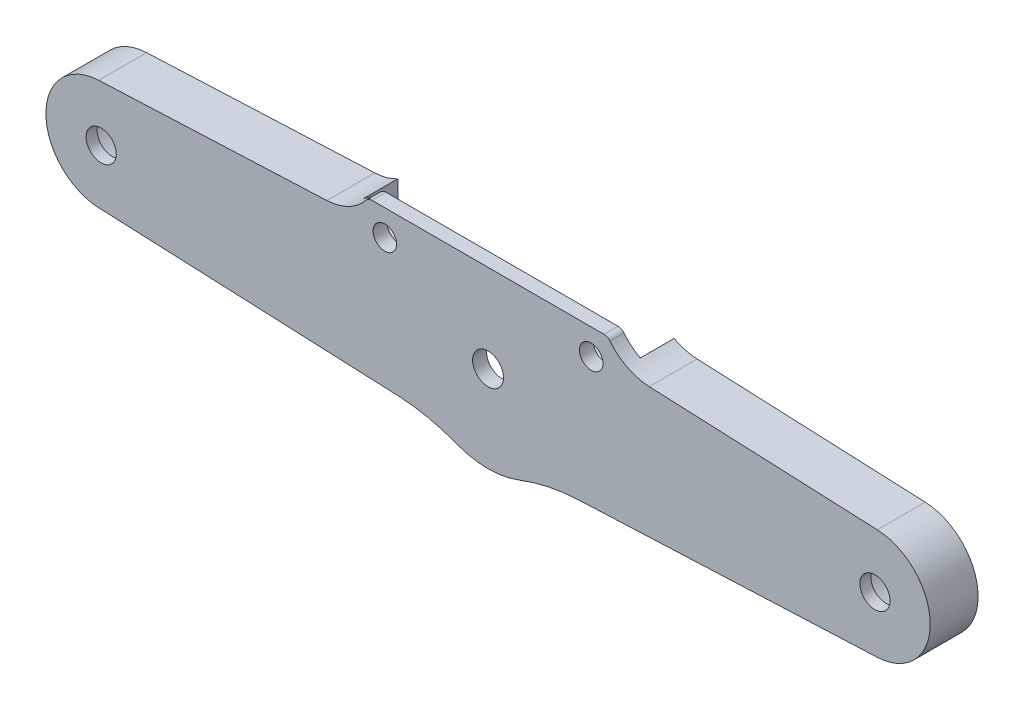
ISO-10303-21;
HEADER;
FILE_DESCRIPTION(('STEP AP214'),'2;1');
FILE_NAME('part.step','',(''),(''),'','','');
FILE_SCHEMA(('AUTOMOTIVE_DESIGN { 1 0 10303 214 1 1 1 1 }'));
ENDSEC;
DATA;
#1=APPLICATION_CONTEXT('core data for automotive mechanical design processes');
#2=APPLICATION_PROTOCOL_DEFINITION('international standard','automotive_design',2000,#1);
#3=PRODUCT_CONTEXT('',#1,'mechanical');
#4=PRODUCT('Part','Part','',(#3));
#5=PRODUCT_RELATED_PRODUCT_CATEGORY('part','',(#4));
#6=PRODUCT_DEFINITION_FORMATION('','',#4);
#7=PRODUCT_DEFINITION_CONTEXT('part definition',#1,'design');
#8=PRODUCT_DEFINITION('design','',#6,#7);
#9=PRODUCT_DEFINITION_SHAPE('','',#8);
#10=(LENGTH_UNIT() NAMED_UNIT(*) SI_UNIT(.MILLI.,.METRE.));
#11=(NAMED_UNIT(*) PLANE_ANGLE_UNIT() SI_UNIT($,.RADIAN.));
#12=(NAMED_UNIT(*) SI_UNIT($,.STERADIAN.) SOLID_ANGLE_UNIT());
#13=UNCERTAINTY_MEASURE_WITH_UNIT(LENGTH_MEASURE(1.E-05),#10,'distance_accuracy_value','');
#14=(GEOMETRIC_REPRESENTATION_CONTEXT(3) GLOBAL_UNCERTAINTY_ASSIGNED_CONTEXT((#13)) GLOBAL_UNIT_ASSIGNED_CONTEXT((#10,
#11,#12)) REPRESENTATION_CONTEXT('',''));
#15=CARTESIAN_POINT('',(0.,0.,0.));
#16=DIRECTION('',(0.,0.,1.));
#17=DIRECTION('',(1.,0.,0.));
#18=AXIS2_PLACEMENT_3D('',#15,#16,#17);
#19=CARTESIAN_POINT('',(-33.5,203.35,52.5));
#20=DIRECTION('',(0.,0.,1.));
#21=DIRECTION('',(1.,0.,0.));
#22=AXIS2_PLACEMENT_3D('',#19,#20,#21);
#23=CYLINDRICAL_SURFACE('',#22,4.);
#24=DIRECTION('',(0.,0.,-1.));
#25=VECTOR('',#24,1.);
#26=CARTESIAN_POINT('',(-33.5,199.35,52.5));
#27=LINE('',#26,#25);
#28=CARTESIAN_POINT('',(-33.5,199.35,61.7));
#29=VERTEX_POINT('',#28);
#30=CARTESIAN_POINT('',(-33.5,199.35,52.5));
#31=VERTEX_POINT('',#30);
#32=EDGE_CURVE('E214',#29,#31,#27,.T.);
#33=ORIENTED_EDGE('',*,*,#32,.T.);
#34=CARTESIAN_POINT('',(-33.5,203.35,52.5));
#35=DIRECTION('',(0.,0.,1.));
#36=DIRECTION('',(1.,0.,0.));
#37=AXIS2_PLACEMENT_3D('',#34,#35,#36);
#38=CIRCLE('',#37,4.);
#39=CARTESIAN_POINT('',(-37.5,203.35,52.5));
#40=VERTEX_POINT('',#39);
#41=EDGE_CURVE('E332',#31,#40,#38,.F.);
#42=ORIENTED_EDGE('',*,*,#41,.T.);
#43=DIRECTION('',(0.,0.,1.));
#44=VECTOR('',#43,1.);
#45=CARTESIAN_POINT('',(-37.5,203.35,52.5));
#46=LINE('',#45,#44);
#47=CARTESIAN_POINT('',(-37.5,203.35,61.7));
#48=VERTEX_POINT('',#47);
#49=EDGE_CURVE('E173',#40,#48,#46,.T.);
#50=ORIENTED_EDGE('',*,*,#49,.T.);
#51=CARTESIAN_POINT('',(-33.5,203.35,61.7));
#52=DIRECTION('',(0.,0.,1.));
#53=DIRECTION('',(1.,0.,0.));
#54=AXIS2_PLACEMENT_3D('',#51,#52,#53);
#55=CIRCLE('',#54,4.);
#56=EDGE_CURVE('E181',#29,#48,#55,.F.);
#57=ORIENTED_EDGE('',*,*,#56,.F.);
#58=EDGE_LOOP('',(#33,#42,#50,#57));
#59=FACE_BOUND('',#58,.T.);
#60=ADVANCED_FACE('F16',(#59),#23,.F.);
#61=CARTESIAN_POINT('',(33.5,203.35,52.5));
#62=DIRECTION('',(0.,0.,1.));
#63=DIRECTION('',(1.,0.,0.));
#64=AXIS2_PLACEMENT_3D('',#61,#62,#63);
#65=CYLINDRICAL_SURFACE('',#64,4.);
#66=DIRECTION('',(0.,0.,1.));
#67=VECTOR('',#66,1.);
#68=CARTESIAN_POINT('',(37.5,203.35,52.5));
#69=LINE('',#68,#67);
#70=CARTESIAN_POINT('',(37.5,203.35,61.7));
#71=VERTEX_POINT('',#70);
#72=CARTESIAN_POINT('',(37.5,203.35,52.5));
#73=VERTEX_POINT('',#72);
#74=EDGE_CURVE('E175',#71,#73,#69,.F.);
#75=ORIENTED_EDGE('',*,*,#74,.T.);
#76=CARTESIAN_POINT('',(33.5,203.35,52.5));
#77=DIRECTION('',(0.,0.,1.));
#78=DIRECTION('',(1.,0.,0.));
#79=AXIS2_PLACEMENT_3D('',#76,#77,#78);
#80=CIRCLE('',#79,4.);
#81=CARTESIAN_POINT('',(33.5,199.35,52.5));
#82=VERTEX_POINT('',#81);
#83=EDGE_CURVE('E19',#73,#82,#80,.F.);
#84=ORIENTED_EDGE('',*,*,#83,.T.);
#85=DIRECTION('',(0.,0.,1.));
#86=VECTOR('',#85,1.);
#87=CARTESIAN_POINT('',(33.5,199.35,52.5));
#88=LINE('',#87,#86);
#89=CARTESIAN_POINT('',(33.5,199.35,61.7));
#90=VERTEX_POINT('',#89);
#91=EDGE_CURVE('E218',#82,#90,#88,.T.);
#92=ORIENTED_EDGE('',*,*,#91,.T.);
#93=CARTESIAN_POINT('',(33.5,203.35,61.7));
#94=DIRECTION('',(0.,0.,1.));
#95=DIRECTION('',(1.,0.,0.));
#96=AXIS2_PLACEMENT_3D('',#93,#94,#95);
#97=CIRCLE('',#96,4.);
#98=EDGE_CURVE('E178',#71,#90,#97,.F.);
#99=ORIENTED_EDGE('',*,*,#98,.F.);
#100=EDGE_LOOP('',(#75,#84,#92,#99));
#101=FACE_BOUND('',#100,.T.);
#102=ADVANCED_FACE('F176',(#101),#65,.F.);
#103=CARTESIAN_POINT('',(17.113664131331,199.35,52.5));
#104=DIRECTION('',(0.,-1.,0.));
#105=DIRECTION('',(1.,0.,0.));
#106=AXIS2_PLACEMENT_3D('',#103,#104,#105);
#107=PLANE('',#106);
#108=DIRECTION('',(1.,0.,0.));
#109=VECTOR('',#108,1.);
#110=CARTESIAN_POINT('',(0.,199.35,52.5));
#111=LINE('',#110,#109);
#112=CARTESIAN_POINT('',(17.1136641313309,199.35,52.5));
#113=VERTEX_POINT('',#112);
#114=EDGE_CURVE('E170',#82,#113,#111,.F.);
#115=ORIENTED_EDGE('',*,*,#114,.T.);
#116=DIRECTION('',(0.,0.,1.));
#117=VECTOR('',#116,1.);
#118=CARTESIAN_POINT('',(17.1136641313309,199.35,52.5));
#119=LINE('',#118,#117);
#120=CARTESIAN_POINT('',(17.1136641313309,199.35,61.7));
#121=VERTEX_POINT('',#120);
#122=EDGE_CURVE('E215',#113,#121,#119,.T.);
#123=ORIENTED_EDGE('',*,*,#122,.T.);
#124=DIRECTION('',(-1.,0.,0.));
#125=VECTOR('',#124,1.);
#126=CARTESIAN_POINT('',(0.,199.35,61.7));
#127=LINE('',#126,#125);
#128=EDGE_CURVE('E323',#90,#121,#127,.T.);
#129=ORIENTED_EDGE('',*,*,#128,.F.);
#130=ORIENTED_EDGE('',*,*,#91,.F.);
#131=EDGE_LOOP('',(#115,#123,#129,#130));
#132=FACE_BOUND('',#131,.T.);
#133=ADVANCED_FACE('F340',(#132),#107,.F.);
#134=CARTESIAN_POINT('',(0.,189.,52.5));
#135=DIRECTION('',(0.,0.,1.));
#136=DIRECTION('',(1.,0.,0.));
#137=AXIS2_PLACEMENT_3D('',#134,#135,#136);
#138=CYLINDRICAL_SURFACE('',#137,20.);
#139=DIRECTION('',(0.,0.,-1.));
#140=VECTOR('',#139,1.);
#141=CARTESIAN_POINT('',(-17.113664131331,199.35,52.5));
#142=LINE('',#141,#140);
#143=CARTESIAN_POINT('',(-17.1136641313309,199.35,52.5));
#144=VERTEX_POINT('',#143);
#145=CARTESIAN_POINT('',(-17.1136641313309,199.35,61.7));
#146=VERTEX_POINT('',#145);
#147=EDGE_CURVE('E212',#144,#146,#142,.F.);
#148=ORIENTED_EDGE('',*,*,#147,.T.);
#149=CARTESIAN_POINT('',(0.,189.,61.7));
#150=DIRECTION('',(0.,0.,1.));
#151=DIRECTION('',(1.,0.,0.));
#152=AXIS2_PLACEMENT_3D('',#149,#150,#151);
#153=CIRCLE('',#152,20.);
#154=EDGE_CURVE('E320',#121,#146,#153,.F.);
#155=ORIENTED_EDGE('',*,*,#154,.F.);
#156=ORIENTED_EDGE('',*,*,#122,.F.);
#157=CARTESIAN_POINT('',(0.,189.,52.5));
#158=DIRECTION('',(0.,0.,1.));
#159=DIRECTION('',(1.,0.,0.));
#160=AXIS2_PLACEMENT_3D('',#157,#158,#159);
#161=CIRCLE('',#160,20.);
#162=EDGE_CURVE('E334',#113,#144,#161,.F.);
#163=ORIENTED_EDGE('',*,*,#162,.T.);
#164=EDGE_LOOP('',(#148,#155,#156,#163));
#165=FACE_BOUND('',#164,.T.);
#166=ADVANCED_FACE('F343',(#165),#138,.F.);
#167=CARTESIAN_POINT('',(-37.5,199.35,52.5));
#168=DIRECTION('',(0.,-1.,0.));
#169=DIRECTION('',(0.,0.,-1.));
#170=AXIS2_PLACEMENT_3D('',#167,#168,#169);
#171=PLANE('',#170);
#172=DIRECTION('',(-1.,0.,0.));
#173=VECTOR('',#172,1.);
#174=CARTESIAN_POINT('',(0.,199.35,61.7));
#175=LINE('',#174,#173);
#176=EDGE_CURVE('E319',#146,#29,#175,.T.);
#177=ORIENTED_EDGE('',*,*,#176,.F.);
#178=ORIENTED_EDGE('',*,*,#147,.F.);
#179=DIRECTION('',(1.,0.,0.));
#180=VECTOR('',#179,1.);
#181=CARTESIAN_POINT('',(0.,199.35,52.5));
#182=LINE('',#181,#180);
#183=EDGE_CURVE('E333',#144,#31,#182,.F.);
#184=ORIENTED_EDGE('',*,*,#183,.T.);
#185=ORIENTED_EDGE('',*,*,#32,.F.);
#186=EDGE_LOOP('',(#177,#178,#184,#185));
#187=FACE_BOUND('',#186,.T.);
#188=ADVANCED_FACE('F350',(#187),#171,.F.);
#189=CARTESIAN_POINT('',(105.,189.,52.5));
#190=DIRECTION('',(0.,0.,1.));
#191=DIRECTION('',(1.,0.,0.));
#192=AXIS2_PLACEMENT_3D('',#189,#190,#191);
#193=CYLINDRICAL_SURFACE('',#192,12.);
#194=CARTESIAN_POINT('',(105.,189.,62.5));
#195=DIRECTION('',(0.,0.,1.));
#196=DIRECTION('',(1.,0.,0.));
#197=AXIS2_PLACEMENT_3D('',#194,#195,#196);
#198=CIRCLE('',#197,12.);
#199=CARTESIAN_POINT('',(117.,189.,62.5));
#200=VERTEX_POINT('',#199);
#201=EDGE_CURVE('E316',#200,#200,#198,.F.);
#202=ORIENTED_EDGE('',*,*,#201,.F.);
#203=EDGE_LOOP('',(#202));
#204=FACE_BOUND('',#203,.T.);
#205=CARTESIAN_POINT('',(105.,189.,52.5));
#206=DIRECTION('',(0.,0.,1.));
#207=DIRECTION('',(1.,0.,0.));
#208=AXIS2_PLACEMENT_3D('',#205,#206,#207);
#209=CIRCLE('',#208,12.);
#210=CARTESIAN_POINT('',(117.,189.,52.5));
#211=VERTEX_POINT('',#210);
#212=EDGE_CURVE('E190',#211,#211,#209,.F.);
#213=ORIENTED_EDGE('',*,*,#212,.T.);
#214=EDGE_LOOP('',(#213));
#215=FACE_BOUND('',#214,.T.);
#216=ADVANCED_FACE('F680',(#204,#215),#193,.F.);
#217=CARTESIAN_POINT('',(-105.,189.,52.5));
#218=DIRECTION('',(0.,0.,1.));
#219=DIRECTION('',(1.,0.,0.));
#220=AXIS2_PLACEMENT_3D('',#217,#218,#219);
#221=CYLINDRICAL_SURFACE('',#220,12.);
#222=CARTESIAN_POINT('',(-105.,189.,62.5));
#223=DIRECTION('',(0.,0.,1.));
#224=DIRECTION('',(1.,0.,0.));
#225=AXIS2_PLACEMENT_3D('',#222,#223,#224);
#226=CIRCLE('',#225,12.);
#227=CARTESIAN_POINT('',(-93.,189.,62.5));
#228=VERTEX_POINT('',#227);
#229=EDGE_CURVE('E313',#228,#228,#226,.F.);
#230=ORIENTED_EDGE('',*,*,#229,.F.);
#231=EDGE_LOOP('',(#230));
#232=FACE_BOUND('',#231,.T.);
#233=CARTESIAN_POINT('',(-105.,189.,52.5));
#234=DIRECTION('',(0.,0.,1.));
#235=DIRECTION('',(1.,0.,0.));
#236=AXIS2_PLACEMENT_3D('',#233,#234,#235);
#237=CIRCLE('',#236,12.);
#238=CARTESIAN_POINT('',(-93.,189.,52.5));
#239=VERTEX_POINT('',#238);
#240=EDGE_CURVE('E187',#239,#239,#237,.F.);
#241=ORIENTED_EDGE('',*,*,#240,.T.);
#242=EDGE_LOOP('',(#241));
#243=FACE_BOUND('',#242,.T.);
#244=ADVANCED_FACE('F672',(#232,#243),#221,.F.);
#245=CARTESIAN_POINT('',(-37.5,208.40608142153,52.5));
#246=DIRECTION('',(-1.,0.,0.));
#247=DIRECTION('',(0.,0.,1.));
#248=AXIS2_PLACEMENT_3D('',#245,#246,#247);
#249=PLANE('',#248);
#250=DIRECTION('',(0.,1.,0.));
#251=VECTOR('',#250,1.);
#252=CARTESIAN_POINT('',(-37.5,189.175,52.5));
#253=LINE('',#252,#251);
#254=CARTESIAN_POINT('',(-37.5000000000001,208.40608142153,52.5));
#255=VERTEX_POINT('',#254);
#256=EDGE_CURVE('E331',#40,#255,#253,.T.);
#257=ORIENTED_EDGE('',*,*,#256,.T.);
#258=DIRECTION('',(0.,0.,1.));
#259=VECTOR('',#258,1.);
#260=CARTESIAN_POINT('',(-37.5000000000001,208.40608142153,52.5));
#261=LINE('',#260,#259);
#262=CARTESIAN_POINT('',(-37.5000000000001,208.40608142153,61.7));
#263=VERTEX_POINT('',#262);
#264=EDGE_CURVE('E208',#255,#263,#261,.T.);
#265=ORIENTED_EDGE('',*,*,#264,.T.);
#266=DIRECTION('',(0.,1.,0.));
#267=VECTOR('',#266,1.);
#268=CARTESIAN_POINT('',(-37.5,190.925,61.7));
#269=LINE('',#268,#267);
#270=EDGE_CURVE('E327',#48,#263,#269,.T.);
#271=ORIENTED_EDGE('',*,*,#270,.F.);
#272=ORIENTED_EDGE('',*,*,#49,.F.);
#273=EDGE_LOOP('',(#257,#265,#271,#272));
#274=FACE_BOUND('',#273,.T.);
#275=ADVANCED_FACE('F370',(#274),#249,.F.);
#276=CARTESIAN_POINT('',(0.,189.175,52.5));
#277=DIRECTION('',(0.,0.,1.));
#278=DIRECTION('',(1.,0.,0.));
#279=AXIS2_PLACEMENT_3D('',#276,#277,#278);
#280=PLANE('',#279);
#281=ORIENTED_EDGE('',*,*,#240,.F.);
#282=EDGE_LOOP('',(#281));
#283=FACE_BOUND('',#282,.T.);
#284=ORIENTED_EDGE('',*,*,#212,.F.);
#285=EDGE_LOOP('',(#284));
#286=FACE_BOUND('',#285,.T.);
#287=ORIENTED_EDGE('',*,*,#41,.F.);
#288=ORIENTED_EDGE('',*,*,#183,.F.);
#289=ORIENTED_EDGE('',*,*,#162,.F.);
#290=ORIENTED_EDGE('',*,*,#114,.F.);
#291=ORIENTED_EDGE('',*,*,#83,.F.);
#292=DIRECTION('',(0.,1.,0.));
#293=VECTOR('',#292,1.);
#294=CARTESIAN_POINT('',(37.5,199.35,52.5));
#295=LINE('',#294,#293);
#296=CARTESIAN_POINT('',(37.5,208.40608142153,52.5));
#297=VERTEX_POINT('',#296);
#298=EDGE_CURVE('E167',#73,#297,#295,.T.);
#299=ORIENTED_EDGE('',*,*,#298,.T.);
#300=CARTESIAN_POINT('',(44.370078815034,221.175263739722,52.5));
#301=DIRECTION('',(0.,0.,1.));
#302=DIRECTION('',(1.,0.,0.));
#303=AXIS2_PLACEMENT_3D('',#300,#301,#302);
#304=CIRCLE('',#303,14.5);
#305=CARTESIAN_POINT('',(43.7375976982367,206.689064526785,52.5));
#306=VERTEX_POINT('',#305);
#307=EDGE_CURVE('E286',#297,#306,#304,.T.);
#308=ORIENTED_EDGE('',*,*,#307,.T.);
#309=DIRECTION('',(-0.999048221581858,0.0436193873653286,0.));
#310=VECTOR('',#309,1.);
#311=CARTESIAN_POINT('',(105.65429081048,203.985723323728,52.5));
#312=LINE('',#311,#310);
#313=CARTESIAN_POINT('',(105.65429081048,203.985723323728,52.5));
#314=VERTEX_POINT('',#313);
#315=EDGE_CURVE('E365',#314,#306,#312,.T.);
#316=ORIENTED_EDGE('',*,*,#315,.F.);
#317=CARTESIAN_POINT('',(105.,189.,52.5));
#318=DIRECTION('',(0.,0.,1.));
#319=DIRECTION('',(1.,0.,0.));
#320=AXIS2_PLACEMENT_3D('',#317,#318,#319);
#321=CIRCLE('',#320,15.);
#322=CARTESIAN_POINT('',(105.65429081048,174.014276676272,52.5));
#323=VERTEX_POINT('',#322);
#324=EDGE_CURVE('E198',#323,#314,#321,.T.);
#325=ORIENTED_EDGE('',*,*,#324,.F.);
#326=DIRECTION('',(0.999048221581858,0.0436193873653353,0.));
#327=VECTOR('',#326,1.);
#328=CARTESIAN_POINT('',(13.8367845227019,170.00543777624,52.5));
#329=LINE('',#328,#327);
#330=CARTESIAN_POINT('',(24.5141938105685,170.471623533568,52.5));
#331=VERTEX_POINT('',#330);
#332=EDGE_CURVE('E195',#331,#323,#329,.T.);
#333=ORIENTED_EDGE('',*,*,#332,.F.);
#334=CARTESIAN_POINT('',(26.6951631788352,120.519212454475,52.5));
#335=DIRECTION('',(0.,0.,1.));
#336=DIRECTION('',(1.,0.,0.));
#337=AXIS2_PLACEMENT_3D('',#334,#335,#336);
#338=CIRCLE('',#337,50.);
#339=CARTESIAN_POINT('',(8.53518822724665,167.104782213336,52.5));
#340=VERTEX_POINT('',#339);
#341=EDGE_CURVE('E292',#331,#340,#338,.T.);
#342=ORIENTED_EDGE('',*,*,#341,.T.);
#343=CARTESIAN_POINT('',(0.,189.,52.5));
#344=DIRECTION('',(0.,0.,1.));
#345=DIRECTION('',(1.,0.,0.));
#346=AXIS2_PLACEMENT_3D('',#343,#344,#345);
#347=CIRCLE('',#346,23.4999999999998);
#348=CARTESIAN_POINT('',(-8.53518822724664,167.104782213336,52.5));
#349=VERTEX_POINT('',#348);
#350=EDGE_CURVE('E296',#349,#340,#347,.T.);
#351=ORIENTED_EDGE('',*,*,#350,.F.);
#352=CARTESIAN_POINT('',(-26.6951631788352,120.519212454475,52.5));
#353=DIRECTION('',(0.,0.,1.));
#354=DIRECTION('',(1.,0.,0.));
#355=AXIS2_PLACEMENT_3D('',#352,#353,#354);
#356=CIRCLE('',#355,50.);
#357=CARTESIAN_POINT('',(-24.5141938105685,170.471623533568,52.5));
#358=VERTEX_POINT('',#357);
#359=EDGE_CURVE('E299',#349,#358,#356,.T.);
#360=ORIENTED_EDGE('',*,*,#359,.T.);
#361=DIRECTION('',(0.999048221581858,-0.0436193873653357,0.));
#362=VECTOR('',#361,1.);
#363=CARTESIAN_POINT('',(-105.65429081048,174.014276676272,52.5));
#364=LINE('',#363,#362);
#365=CARTESIAN_POINT('',(-105.65429081048,174.014276676272,52.5));
#366=VERTEX_POINT('',#365);
#367=EDGE_CURVE('E200',#366,#358,#364,.T.);
#368=ORIENTED_EDGE('',*,*,#367,.F.);
#369=CARTESIAN_POINT('',(-105.,189.,52.5));
#370=DIRECTION('',(0.,0.,1.));
#371=DIRECTION('',(1.,0.,0.));
#372=AXIS2_PLACEMENT_3D('',#369,#370,#371);
#373=CIRCLE('',#372,15.);
#374=CARTESIAN_POINT('',(-105.65429081048,203.985723323728,52.5));
#375=VERTEX_POINT('',#374);
#376=EDGE_CURVE('E302',#375,#366,#373,.T.);
#377=ORIENTED_EDGE('',*,*,#376,.F.);
#378=DIRECTION('',(-0.999048221581858,-0.0436193873653279,0.));
#379=VECTOR('',#378,1.);
#380=CARTESIAN_POINT('',(-43.7375976982367,206.689064526785,52.5));
#381=LINE('',#380,#379);
#382=CARTESIAN_POINT('',(-43.7375976982367,206.689064526785,52.5));
#383=VERTEX_POINT('',#382);
#384=EDGE_CURVE('E204',#383,#375,#381,.T.);
#385=ORIENTED_EDGE('',*,*,#384,.F.);
#386=CARTESIAN_POINT('',(-44.370078815034,221.175263739722,52.5));
#387=DIRECTION('',(0.,0.,1.));
#388=DIRECTION('',(1.,0.,0.));
#389=AXIS2_PLACEMENT_3D('',#386,#387,#388);
#390=CIRCLE('',#389,14.5);
#391=EDGE_CURVE('E211',#383,#255,#390,.T.);
#392=ORIENTED_EDGE('',*,*,#391,.T.);
#393=ORIENTED_EDGE('',*,*,#256,.F.);
#394=EDGE_LOOP('',(#287,#288,#289,#290,#291,#299,#308,#316,#325,#333,#342,#351,#360,#368,#377,
#385,#392,#393));
#395=FACE_BOUND('',#394,.T.);
#396=ADVANCED_FACE('F165',(#283,#286,#395),#280,.F.);
#397=CARTESIAN_POINT('',(37.5,199.35,52.5));
#398=DIRECTION('',(1.,0.,0.));
#399=DIRECTION('',(0.,1.,0.));
#400=AXIS2_PLACEMENT_3D('',#397,#398,#399);
#401=PLANE('',#400);
#402=DIRECTION('',(0.,1.,0.));
#403=VECTOR('',#402,1.);
#404=CARTESIAN_POINT('',(37.5,190.925,61.7));
#405=LINE('',#404,#403);
#406=CARTESIAN_POINT('',(37.5000000000001,208.40608142153,61.7));
#407=VERTEX_POINT('',#406);
#408=EDGE_CURVE('E325',#407,#71,#405,.F.);
#409=ORIENTED_EDGE('',*,*,#408,.F.);
#410=DIRECTION('',(0.,0.,1.));
#411=VECTOR('',#410,1.);
#412=CARTESIAN_POINT('',(37.5000000000001,208.40608142153,52.5));
#413=LINE('',#412,#411);
#414=EDGE_CURVE('E185',#407,#297,#413,.F.);
#415=ORIENTED_EDGE('',*,*,#414,.T.);
#416=ORIENTED_EDGE('',*,*,#298,.F.);
#417=ORIENTED_EDGE('',*,*,#74,.F.);
#418=EDGE_LOOP('',(#409,#415,#416,#417));
#419=FACE_BOUND('',#418,.T.);
#420=ADVANCED_FACE('F183',(#419),#401,.F.);
#421=CARTESIAN_POINT('',(0.,190.925,61.7));
#422=DIRECTION('',(0.,0.,-1.));
#423=DIRECTION('',(-1.,0.,0.));
#424=AXIS2_PLACEMENT_3D('',#421,#422,#423);
#425=PLANE('',#424);
#426=CARTESIAN_POINT('',(-28.,205.85,61.7));
#427=DIRECTION('',(0.,0.,-1.));
#428=DIRECTION('',(-1.,0.,0.));
#429=AXIS2_PLACEMENT_3D('',#426,#427,#428);
#430=CIRCLE('',#429,3.2);
#431=CARTESIAN_POINT('',(-31.2,205.85,61.7));
#432=VERTEX_POINT('',#431);
#433=EDGE_CURVE('E270',#432,#432,#430,.F.);
#434=ORIENTED_EDGE('',*,*,#433,.T.);
#435=EDGE_LOOP('',(#434));
#436=FACE_BOUND('',#435,.T.);
#437=CARTESIAN_POINT('',(28.,205.85,61.7));
#438=DIRECTION('',(0.,0.,-1.));
#439=DIRECTION('',(-1.,0.,0.));
#440=AXIS2_PLACEMENT_3D('',#437,#438,#439);
#441=CIRCLE('',#440,3.2);
#442=CARTESIAN_POINT('',(24.8,205.85,61.7));
#443=VERTEX_POINT('',#442);
#444=EDGE_CURVE('E273',#443,#443,#441,.F.);
#445=ORIENTED_EDGE('',*,*,#444,.T.);
#446=EDGE_LOOP('',(#445));
#447=FACE_BOUND('',#446,.T.);
#448=CARTESIAN_POINT('',(0.,189.,61.7));
#449=DIRECTION('',(0.,0.,-1.));
#450=DIRECTION('',(-1.,0.,0.));
#451=AXIS2_PLACEMENT_3D('',#448,#449,#450);
#452=CIRCLE('',#451,4.2);
#453=CARTESIAN_POINT('',(-4.2,189.,61.7));
#454=VERTEX_POINT('',#453);
#455=EDGE_CURVE('E276',#454,#454,#452,.F.);
#456=ORIENTED_EDGE('',*,*,#455,.T.);
#457=EDGE_LOOP('',(#456));
#458=FACE_BOUND('',#457,.T.);
#459=ORIENTED_EDGE('',*,*,#154,.T.);
#460=ORIENTED_EDGE('',*,*,#176,.T.);
#461=ORIENTED_EDGE('',*,*,#56,.T.);
#462=ORIENTED_EDGE('',*,*,#270,.T.);
#463=CARTESIAN_POINT('',(-44.370078815034,221.175263739722,61.7));
#464=DIRECTION('',(0.,0.,1.));
#465=DIRECTION('',(1.,0.,0.));
#466=AXIS2_PLACEMENT_3D('',#463,#464,#465);
#467=CIRCLE('',#466,14.5);
#468=CARTESIAN_POINT('',(-33.0600095533376,212.101547119966,61.7));
#469=VERTEX_POINT('',#468);
#470=EDGE_CURVE('E308',#263,#469,#467,.T.);
#471=ORIENTED_EDGE('',*,*,#470,.T.);
#472=CARTESIAN_POINT('',(-31.5,210.85,61.7));
#473=DIRECTION('',(0.,0.,1.));
#474=DIRECTION('',(1.,0.,0.));
#475=AXIS2_PLACEMENT_3D('',#472,#473,#474);
#476=CIRCLE('',#475,2.);
#477=CARTESIAN_POINT('',(-31.5,212.85,61.7));
#478=VERTEX_POINT('',#477);
#479=EDGE_CURVE('E310',#478,#469,#476,.T.);
#480=ORIENTED_EDGE('',*,*,#479,.F.);
#481=DIRECTION('',(-1.,0.,0.));
#482=VECTOR('',#481,1.);
#483=CARTESIAN_POINT('',(31.5,212.85,61.7));
#484=LINE('',#483,#482);
#485=CARTESIAN_POINT('',(31.5,212.85,61.7));
#486=VERTEX_POINT('',#485);
#487=EDGE_CURVE('E360',#486,#478,#484,.T.);
#488=ORIENTED_EDGE('',*,*,#487,.F.);
#489=CARTESIAN_POINT('',(31.5,210.85,61.7));
#490=DIRECTION('',(0.,0.,1.));
#491=DIRECTION('',(1.,0.,0.));
#492=AXIS2_PLACEMENT_3D('',#489,#490,#491);
#493=CIRCLE('',#492,2.00000000000001);
#494=CARTESIAN_POINT('',(33.0600095533375,212.101547119966,61.7));
#495=VERTEX_POINT('',#494);
#496=EDGE_CURVE('E279',#495,#486,#493,.T.);
#497=ORIENTED_EDGE('',*,*,#496,.F.);
#498=CARTESIAN_POINT('',(44.370078815034,221.175263739722,61.7));
#499=DIRECTION('',(0.,0.,1.));
#500=DIRECTION('',(1.,0.,0.));
#501=AXIS2_PLACEMENT_3D('',#498,#499,#500);
#502=CIRCLE('',#501,14.5);
#503=EDGE_CURVE('E282',#495,#407,#502,.T.);
#504=ORIENTED_EDGE('',*,*,#503,.T.);
#505=ORIENTED_EDGE('',*,*,#408,.T.);
#506=ORIENTED_EDGE('',*,*,#98,.T.);
#507=ORIENTED_EDGE('',*,*,#128,.T.);
#508=EDGE_LOOP('',(#459,#460,#461,#462,#471,#480,#488,#497,#504,#505,#506,#507));
#509=FACE_BOUND('',#508,.T.);
#510=ADVANCED_FACE('F354',(#436,#447,#458,#509),#425,.T.);
#511=CARTESIAN_POINT('',(105.,189.,62.5));
#512=DIRECTION('',(0.,0.,-1.));
#513=DIRECTION('',(-1.,0.,0.));
#514=AXIS2_PLACEMENT_3D('',#511,#512,#513);
#515=PLANE('',#514);
#516=CARTESIAN_POINT('',(105.,189.,62.5));
#517=DIRECTION('',(0.,0.,-1.));
#518=DIRECTION('',(0.,1.,0.));
#519=AXIS2_PLACEMENT_3D('',#516,#517,#518);
#520=CIRCLE('',#519,4.1);
#521=CARTESIAN_POINT('',(105.,193.1,62.5));
#522=VERTEX_POINT('',#521);
#523=EDGE_CURVE('E267',#522,#522,#520,.F.);
#524=ORIENTED_EDGE('',*,*,#523,.T.);
#525=EDGE_LOOP('',(#524));
#526=FACE_BOUND('',#525,.T.);
#527=ORIENTED_EDGE('',*,*,#201,.T.);
#528=EDGE_LOOP('',(#527));
#529=FACE_BOUND('',#528,.T.);
#530=ADVANCED_FACE('F632',(#526,#529),#515,.T.);
#531=CARTESIAN_POINT('',(-105.,189.,62.5));
#532=DIRECTION('',(0.,0.,-1.));
#533=DIRECTION('',(-1.,0.,0.));
#534=AXIS2_PLACEMENT_3D('',#531,#532,#533);
#535=PLANE('',#534);
#536=CARTESIAN_POINT('',(-105.,189.,62.5));
#537=DIRECTION('',(0.,0.,-1.));
#538=DIRECTION('',(0.,1.,0.));
#539=AXIS2_PLACEMENT_3D('',#536,#537,#538);
#540=CIRCLE('',#539,4.1);
#541=CARTESIAN_POINT('',(-105.,193.1,62.5));
#542=VERTEX_POINT('',#541);
#543=EDGE_CURVE('E264',#542,#542,#540,.F.);
#544=ORIENTED_EDGE('',*,*,#543,.T.);
#545=EDGE_LOOP('',(#544));
#546=FACE_BOUND('',#545,.T.);
#547=ORIENTED_EDGE('',*,*,#229,.T.);
#548=EDGE_LOOP('',(#547));
#549=FACE_BOUND('',#548,.T.);
#550=ADVANCED_FACE('F624',(#546,#549),#535,.T.);
#551=CARTESIAN_POINT('',(-31.5,210.85,52.5));
#552=DIRECTION('',(0.,0.,1.));
#553=DIRECTION('',(1.,0.,0.));
#554=AXIS2_PLACEMENT_3D('',#551,#552,#553);
#555=CYLINDRICAL_SURFACE('',#554,2.);
#556=CARTESIAN_POINT('',(-31.5,210.85,65.5));
#557=DIRECTION('',(0.,0.,1.));
#558=DIRECTION('',(1.,0.,0.));
#559=AXIS2_PLACEMENT_3D('',#556,#557,#558);
#560=CIRCLE('',#559,2.);
#561=CARTESIAN_POINT('',(-31.5,212.85,65.5));
#562=VERTEX_POINT('',#561);
#563=CARTESIAN_POINT('',(-33.0600095533376,212.101547119966,65.5));
#564=VERTEX_POINT('',#563);
#565=EDGE_CURVE('E261',#562,#564,#560,.T.);
#566=ORIENTED_EDGE('',*,*,#565,.F.);
#567=DIRECTION('',(0.,0.,1.));
#568=VECTOR('',#567,1.);
#569=CARTESIAN_POINT('',(-31.5,212.85,52.5));
#570=LINE('',#569,#568);
#571=EDGE_CURVE('E363',#478,#562,#570,.T.);
#572=ORIENTED_EDGE('',*,*,#571,.F.);
#573=ORIENTED_EDGE('',*,*,#479,.T.);
#574=DIRECTION('',(0.,0.,1.));
#575=VECTOR('',#574,1.);
#576=CARTESIAN_POINT('',(-33.0600095533377,212.101547119966,52.5));
#577=LINE('',#576,#575);
#578=EDGE_CURVE('E307',#469,#564,#577,.T.);
#579=ORIENTED_EDGE('',*,*,#578,.T.);
#580=EDGE_LOOP('',(#566,#572,#573,#579));
#581=FACE_BOUND('',#580,.T.);
#582=ADVANCED_FACE('F382',(#581),#555,.T.);
#583=CARTESIAN_POINT('',(-44.370078815034,221.175263739722,52.5));
#584=DIRECTION('',(0.,0.,1.));
#585=DIRECTION('',(1.,0.,0.));
#586=AXIS2_PLACEMENT_3D('',#583,#584,#585);
#587=CYLINDRICAL_SURFACE('',#586,14.5);
#588=ORIENTED_EDGE('',*,*,#391,.F.);
#589=DIRECTION('',(0.,0.,1.));
#590=VECTOR('',#589,1.);
#591=CARTESIAN_POINT('',(-43.7375976982367,206.689064526785,52.5));
#592=LINE('',#591,#590);
#593=CARTESIAN_POINT('',(-43.7375976982367,206.689064526785,65.5));
#594=VERTEX_POINT('',#593);
#595=EDGE_CURVE('E207',#594,#383,#592,.F.);
#596=ORIENTED_EDGE('',*,*,#595,.F.);
#597=CARTESIAN_POINT('',(-44.370078815034,221.175263739722,65.5));
#598=DIRECTION('',(0.,0.,1.));
#599=DIRECTION('',(1.,0.,0.));
#600=AXIS2_PLACEMENT_3D('',#597,#598,#599);
#601=CIRCLE('',#600,14.5);
#602=EDGE_CURVE('E258',#564,#594,#601,.F.);
#603=ORIENTED_EDGE('',*,*,#602,.F.);
#604=ORIENTED_EDGE('',*,*,#578,.F.);
#605=ORIENTED_EDGE('',*,*,#470,.F.);
#606=ORIENTED_EDGE('',*,*,#264,.F.);
#607=EDGE_LOOP('',(#588,#596,#603,#604,#605,#606));
#608=FACE_BOUND('',#607,.T.);
#609=ADVANCED_FACE('F377',(#608),#587,.F.);
#610=CARTESIAN_POINT('',(-43.7375976982367,206.689064526785,52.5));
#611=DIRECTION('',(-0.0436193873653279,0.999048221581858,0.));
#612=DIRECTION('',(-0.999048221581858,-0.0436193873653279,0.));
#613=AXIS2_PLACEMENT_3D('',#610,#611,#612);
#614=PLANE('',#613);
#615=DIRECTION('',(-0.999048221581858,-0.0436193873653274,0.));
#616=VECTOR('',#615,1.);
#617=CARTESIAN_POINT('',(-43.7375976982367,206.689064526785,65.5));
#618=LINE('',#617,#616);
#619=CARTESIAN_POINT('',(-105.65429081048,203.985723323728,65.5));
#620=VERTEX_POINT('',#619);
#621=EDGE_CURVE('E257',#594,#620,#618,.T.);
#622=ORIENTED_EDGE('',*,*,#621,.F.);
#623=ORIENTED_EDGE('',*,*,#595,.T.);
#624=ORIENTED_EDGE('',*,*,#384,.T.);
#625=DIRECTION('',(0.,0.,1.));
#626=VECTOR('',#625,1.);
#627=CARTESIAN_POINT('',(-105.65429081048,203.985723323728,52.5));
#628=LINE('',#627,#626);
#629=EDGE_CURVE('E304',#620,#375,#628,.F.);
#630=ORIENTED_EDGE('',*,*,#629,.F.);
#631=EDGE_LOOP('',(#622,#623,#624,#630));
#632=FACE_BOUND('',#631,.T.);
#633=ADVANCED_FACE('F413',(#632),#614,.T.);
#634=CARTESIAN_POINT('',(-105.,189.,52.5));
#635=DIRECTION('',(0.,0.,1.));
#636=DIRECTION('',(1.,0.,0.));
#637=AXIS2_PLACEMENT_3D('',#634,#635,#636);
#638=CYLINDRICAL_SURFACE('',#637,15.);
#639=CARTESIAN_POINT('',(-105.,189.,65.5));
#640=DIRECTION('',(0.,0.,1.));
#641=DIRECTION('',(1.,0.,0.));
#642=AXIS2_PLACEMENT_3D('',#639,#640,#641);
#643=CIRCLE('',#642,15.);
#644=CARTESIAN_POINT('',(-105.65429081048,174.014276676272,65.5));
#645=VERTEX_POINT('',#644);
#646=EDGE_CURVE('E254',#620,#645,#643,.T.);
#647=ORIENTED_EDGE('',*,*,#646,.F.);
#648=ORIENTED_EDGE('',*,*,#629,.T.);
#649=ORIENTED_EDGE('',*,*,#376,.T.);
#650=DIRECTION('',(0.,0.,1.));
#651=VECTOR('',#650,1.);
#652=CARTESIAN_POINT('',(-105.65429081048,174.014276676272,52.5));
#653=LINE('',#652,#651);
#654=EDGE_CURVE('E203',#645,#366,#653,.F.);
#655=ORIENTED_EDGE('',*,*,#654,.F.);
#656=EDGE_LOOP('',(#647,#648,#649,#655));
#657=FACE_BOUND('',#656,.T.);
#658=ADVANCED_FACE('F428',(#657),#638,.T.);
#659=CARTESIAN_POINT('',(-105.65429081048,174.014276676272,52.5));
#660=DIRECTION('',(-0.0436193873653357,-0.999048221581858,0.));
#661=DIRECTION('',(0.999048221581858,-0.0436193873653357,0.));
#662=AXIS2_PLACEMENT_3D('',#659,#660,#661);
#663=PLANE('',#662);
#664=ORIENTED_EDGE('',*,*,#654,.T.);
#665=ORIENTED_EDGE('',*,*,#367,.T.);
#666=DIRECTION('',(0.,0.,1.));
#667=VECTOR('',#666,1.);
#668=CARTESIAN_POINT('',(-24.5141938105685,170.471623533568,52.5));
#669=LINE('',#668,#667);
#670=CARTESIAN_POINT('',(-24.5141938105685,170.471623533568,65.5));
#671=VERTEX_POINT('',#670);
#672=EDGE_CURVE('E202',#358,#671,#669,.T.);
#673=ORIENTED_EDGE('',*,*,#672,.T.);
#674=DIRECTION('',(0.999048221581858,-0.043619387365333,0.));
#675=VECTOR('',#674,1.);
#676=CARTESIAN_POINT('',(-105.65429081048,174.014276676272,65.5));
#677=LINE('',#676,#675);
#678=EDGE_CURVE('E253',#645,#671,#677,.T.);
#679=ORIENTED_EDGE('',*,*,#678,.F.);
#680=EDGE_LOOP('',(#664,#665,#673,#679));
#681=FACE_BOUND('',#680,.T.);
#682=ADVANCED_FACE('F431',(#681),#663,.T.);
#683=CARTESIAN_POINT('',(-26.6951631788352,120.519212454475,52.5));
#684=DIRECTION('',(0.,0.,1.));
#685=DIRECTION('',(1.,0.,0.));
#686=AXIS2_PLACEMENT_3D('',#683,#684,#685);
#687=CYLINDRICAL_SURFACE('',#686,50.);
#688=DIRECTION('',(0.,0.,1.));
#689=VECTOR('',#688,1.);
#690=CARTESIAN_POINT('',(-8.53518822724671,167.104782213336,52.5));
#691=LINE('',#690,#689);
#692=CARTESIAN_POINT('',(-8.53518822724664,167.104782213336,65.5));
#693=VERTEX_POINT('',#692);
#694=EDGE_CURVE('E298',#693,#349,#691,.F.);
#695=ORIENTED_EDGE('',*,*,#694,.F.);
#696=CARTESIAN_POINT('',(-26.6951631788352,120.519212454475,65.5));
#697=DIRECTION('',(0.,0.,1.));
#698=DIRECTION('',(1.,0.,0.));
#699=AXIS2_PLACEMENT_3D('',#696,#697,#698);
#700=CIRCLE('',#699,50.);
#701=EDGE_CURVE('E250',#671,#693,#700,.F.);
#702=ORIENTED_EDGE('',*,*,#701,.F.);
#703=ORIENTED_EDGE('',*,*,#672,.F.);
#704=ORIENTED_EDGE('',*,*,#359,.F.);
#705=EDGE_LOOP('',(#695,#702,#703,#704));
#706=FACE_BOUND('',#705,.T.);
#707=ADVANCED_FACE('F435',(#706),#687,.F.);
#708=CARTESIAN_POINT('',(0.,189.,52.5));
#709=DIRECTION('',(0.,0.,1.));
#710=DIRECTION('',(1.,0.,0.));
#711=AXIS2_PLACEMENT_3D('',#708,#709,#710);
#712=CYLINDRICAL_SURFACE('',#711,23.4999999999998);
#713=ORIENTED_EDGE('',*,*,#694,.T.);
#714=ORIENTED_EDGE('',*,*,#350,.T.);
#715=DIRECTION('',(0.,0.,1.));
#716=VECTOR('',#715,1.);
#717=CARTESIAN_POINT('',(8.53518822724672,167.104782213336,52.5));
#718=LINE('',#717,#716);
#719=CARTESIAN_POINT('',(8.53518822724665,167.104782213336,65.5));
#720=VERTEX_POINT('',#719);
#721=EDGE_CURVE('E295',#340,#720,#718,.T.);
#722=ORIENTED_EDGE('',*,*,#721,.T.);
#723=CARTESIAN_POINT('',(0.,189.,65.5));
#724=DIRECTION('',(0.,0.,1.));
#725=DIRECTION('',(1.,0.,0.));
#726=AXIS2_PLACEMENT_3D('',#723,#724,#725);
#727=CIRCLE('',#726,23.4999999999998);
#728=EDGE_CURVE('E247',#693,#720,#727,.T.);
#729=ORIENTED_EDGE('',*,*,#728,.F.);
#730=EDGE_LOOP('',(#713,#714,#722,#729));
#731=FACE_BOUND('',#730,.T.);
#732=ADVANCED_FACE('F439',(#731),#712,.T.);
#733=CARTESIAN_POINT('',(26.6951631788352,120.519212454475,52.5));
#734=DIRECTION('',(0.,0.,1.));
#735=DIRECTION('',(1.,0.,0.));
#736=AXIS2_PLACEMENT_3D('',#733,#734,#735);
#737=CYLINDRICAL_SURFACE('',#736,50.);
#738=DIRECTION('',(0.,0.,1.));
#739=VECTOR('',#738,1.);
#740=CARTESIAN_POINT('',(24.5141938105685,170.471623533568,52.5));
#741=LINE('',#740,#739);
#742=CARTESIAN_POINT('',(24.5141938105685,170.471623533568,65.5));
#743=VERTEX_POINT('',#742);
#744=EDGE_CURVE('E199',#743,#331,#741,.F.);
#745=ORIENTED_EDGE('',*,*,#744,.F.);
#746=CARTESIAN_POINT('',(26.6951631788352,120.519212454475,65.5));
#747=DIRECTION('',(0.,0.,1.));
#748=DIRECTION('',(1.,0.,0.));
#749=AXIS2_PLACEMENT_3D('',#746,#747,#748);
#750=CIRCLE('',#749,50.);
#751=EDGE_CURVE('E244',#720,#743,#750,.F.);
#752=ORIENTED_EDGE('',*,*,#751,.F.);
#753=ORIENTED_EDGE('',*,*,#721,.F.);
#754=ORIENTED_EDGE('',*,*,#341,.F.);
#755=EDGE_LOOP('',(#745,#752,#753,#754));
#756=FACE_BOUND('',#755,.T.);
#757=ADVANCED_FACE('F443',(#756),#737,.F.);
#758=CARTESIAN_POINT('',(13.8367845227019,170.00543777624,52.5));
#759=DIRECTION('',(0.0436193873653353,-0.999048221581858,0.));
#760=DIRECTION('',(0.999048221581858,0.0436193873653353,0.));
#761=AXIS2_PLACEMENT_3D('',#758,#759,#760);
#762=PLANE('',#761);
#763=DIRECTION('',(0.,0.,1.));
#764=VECTOR('',#763,1.);
#765=CARTESIAN_POINT('',(105.65429081048,174.014276676272,52.5));
#766=LINE('',#765,#764);
#767=CARTESIAN_POINT('',(105.65429081048,174.014276676272,65.5));
#768=VERTEX_POINT('',#767);
#769=EDGE_CURVE('E291',#768,#323,#766,.F.);
#770=ORIENTED_EDGE('',*,*,#769,.F.);
#771=DIRECTION('',(0.999048221581858,0.043619387365333,0.));
#772=VECTOR('',#771,1.);
#773=CARTESIAN_POINT('',(24.5141938105685,170.471623533568,65.5));
#774=LINE('',#773,#772);
#775=EDGE_CURVE('E243',#743,#768,#774,.T.);
#776=ORIENTED_EDGE('',*,*,#775,.F.);
#777=ORIENTED_EDGE('',*,*,#744,.T.);
#778=ORIENTED_EDGE('',*,*,#332,.T.);
#779=EDGE_LOOP('',(#770,#776,#777,#778));
#780=FACE_BOUND('',#779,.T.);
#781=ADVANCED_FACE('F447',(#780),#762,.T.);
#782=CARTESIAN_POINT('',(105.,189.,52.5));
#783=DIRECTION('',(0.,0.,1.));
#784=DIRECTION('',(1.,0.,0.));
#785=AXIS2_PLACEMENT_3D('',#782,#783,#784);
#786=CYLINDRICAL_SURFACE('',#785,15.);
#787=CARTESIAN_POINT('',(105.,189.,65.5));
#788=DIRECTION('',(0.,0.,1.));
#789=DIRECTION('',(1.,0.,0.));
#790=AXIS2_PLACEMENT_3D('',#787,#788,#789);
#791=CIRCLE('',#790,15.);
#792=CARTESIAN_POINT('',(105.65429081048,203.985723323728,65.5));
#793=VERTEX_POINT('',#792);
#794=EDGE_CURVE('E240',#768,#793,#791,.T.);
#795=ORIENTED_EDGE('',*,*,#794,.F.);
#796=ORIENTED_EDGE('',*,*,#769,.T.);
#797=ORIENTED_EDGE('',*,*,#324,.T.);
#798=DIRECTION('',(0.,0.,1.));
#799=VECTOR('',#798,1.);
#800=CARTESIAN_POINT('',(105.65429081048,203.985723323728,52.5));
#801=LINE('',#800,#799);
#802=EDGE_CURVE('E288',#793,#314,#801,.F.);
#803=ORIENTED_EDGE('',*,*,#802,.F.);
#804=EDGE_LOOP('',(#795,#796,#797,#803));
#805=FACE_BOUND('',#804,.T.);
#806=ADVANCED_FACE('F451',(#805),#786,.T.);
#807=CARTESIAN_POINT('',(105.65429081048,203.985723323728,52.5));
#808=DIRECTION('',(0.0436193873653286,0.999048221581858,0.));
#809=DIRECTION('',(-0.999048221581858,0.0436193873653286,0.));
#810=AXIS2_PLACEMENT_3D('',#807,#808,#809);
#811=PLANE('',#810);
#812=DIRECTION('',(-0.999048221581858,0.0436193873653274,0.));
#813=VECTOR('',#812,1.);
#814=CARTESIAN_POINT('',(105.65429081048,203.985723323728,65.5));
#815=LINE('',#814,#813);
#816=CARTESIAN_POINT('',(43.7375976982367,206.689064526785,65.5));
#817=VERTEX_POINT('',#816);
#818=EDGE_CURVE('E239',#793,#817,#815,.T.);
#819=ORIENTED_EDGE('',*,*,#818,.F.);
#820=ORIENTED_EDGE('',*,*,#802,.T.);
#821=ORIENTED_EDGE('',*,*,#315,.T.);
#822=DIRECTION('',(0.,0.,1.));
#823=VECTOR('',#822,1.);
#824=CARTESIAN_POINT('',(43.7375976982367,206.689064526785,52.5));
#825=LINE('',#824,#823);
#826=EDGE_CURVE('E285',#306,#817,#825,.T.);
#827=ORIENTED_EDGE('',*,*,#826,.T.);
#828=EDGE_LOOP('',(#819,#820,#821,#827));
#829=FACE_BOUND('',#828,.T.);
#830=ADVANCED_FACE('F453',(#829),#811,.T.);
#831=CARTESIAN_POINT('',(44.370078815034,221.175263739722,52.5));
#832=DIRECTION('',(0.,0.,1.));
#833=DIRECTION('',(1.,0.,0.));
#834=AXIS2_PLACEMENT_3D('',#831,#832,#833);
#835=CYLINDRICAL_SURFACE('',#834,14.5);
#836=ORIENTED_EDGE('',*,*,#503,.F.);
#837=DIRECTION('',(0.,0.,1.));
#838=VECTOR('',#837,1.);
#839=CARTESIAN_POINT('',(33.0600095533376,212.101547119966,52.5));
#840=LINE('',#839,#838);
#841=CARTESIAN_POINT('',(33.0600095533375,212.101547119966,65.5));
#842=VERTEX_POINT('',#841);
#843=EDGE_CURVE('E281',#842,#495,#840,.F.);
#844=ORIENTED_EDGE('',*,*,#843,.F.);
#845=CARTESIAN_POINT('',(44.370078815034,221.175263739722,65.5));
#846=DIRECTION('',(0.,0.,1.));
#847=DIRECTION('',(1.,0.,0.));
#848=AXIS2_PLACEMENT_3D('',#845,#846,#847);
#849=CIRCLE('',#848,14.5);
#850=EDGE_CURVE('E236',#817,#842,#849,.F.);
#851=ORIENTED_EDGE('',*,*,#850,.F.);
#852=ORIENTED_EDGE('',*,*,#826,.F.);
#853=ORIENTED_EDGE('',*,*,#307,.F.);
#854=ORIENTED_EDGE('',*,*,#414,.F.);
#855=EDGE_LOOP('',(#836,#844,#851,#852,#853,#854));
#856=FACE_BOUND('',#855,.T.);
#857=ADVANCED_FACE('F455',(#856),#835,.F.);
#858=CARTESIAN_POINT('',(31.5,210.85,52.5));
#859=DIRECTION('',(0.,0.,1.));
#860=DIRECTION('',(1.,0.,0.));
#861=AXIS2_PLACEMENT_3D('',#858,#859,#860);
#862=CYLINDRICAL_SURFACE('',#861,2.00000000000001);
#863=CARTESIAN_POINT('',(31.5,210.85,65.5));
#864=DIRECTION('',(0.,0.,1.));
#865=DIRECTION('',(1.,0.,0.));
#866=AXIS2_PLACEMENT_3D('',#863,#864,#865);
#867=CIRCLE('',#866,2.00000000000001);
#868=CARTESIAN_POINT('',(31.5,212.85,65.5));
#869=VERTEX_POINT('',#868);
#870=EDGE_CURVE('E233',#842,#869,#867,.T.);
#871=ORIENTED_EDGE('',*,*,#870,.F.);
#872=ORIENTED_EDGE('',*,*,#843,.T.);
#873=ORIENTED_EDGE('',*,*,#496,.T.);
#874=DIRECTION('',(0.,0.,1.));
#875=VECTOR('',#874,1.);
#876=CARTESIAN_POINT('',(31.5,212.85,52.5));
#877=LINE('',#876,#875);
#878=EDGE_CURVE('E34',#869,#486,#877,.F.);
#879=ORIENTED_EDGE('',*,*,#878,.F.);
#880=EDGE_LOOP('',(#871,#872,#873,#879));
#881=FACE_BOUND('',#880,.T.);
#882=ADVANCED_FACE('F390',(#881),#862,.T.);
#883=CARTESIAN_POINT('',(31.5,212.85,52.5));
#884=DIRECTION('',(0.,1.,0.));
#885=DIRECTION('',(-1.,0.,0.));
#886=AXIS2_PLACEMENT_3D('',#883,#884,#885);
#887=PLANE('',#886);
#888=DIRECTION('',(1.,0.,0.));
#889=VECTOR('',#888,1.);
#890=CARTESIAN_POINT('',(0.,212.85,65.5));
#891=LINE('',#890,#889);
#892=EDGE_CURVE('E232',#869,#562,#891,.F.);
#893=ORIENTED_EDGE('',*,*,#892,.F.);
#894=ORIENTED_EDGE('',*,*,#878,.T.);
#895=ORIENTED_EDGE('',*,*,#487,.T.);
#896=ORIENTED_EDGE('',*,*,#571,.T.);
#897=EDGE_LOOP('',(#893,#894,#895,#896));
#898=FACE_BOUND('',#897,.T.);
#899=ADVANCED_FACE('F387',(#898),#887,.T.);
#900=CARTESIAN_POINT('',(0.,189.,63.287));
#901=DIRECTION('',(0.,0.,-1.));
#902=DIRECTION('',(-1.,0.,0.));
#903=AXIS2_PLACEMENT_3D('',#900,#901,#902);
#904=CYLINDRICAL_SURFACE('',#903,4.2);
#905=ORIENTED_EDGE('',*,*,#455,.F.);
#906=EDGE_LOOP('',(#905));
#907=FACE_BOUND('',#906,.T.);
#908=CARTESIAN_POINT('',(0.,189.,65.5));
#909=DIRECTION('',(0.,0.,-1.));
#910=DIRECTION('',(-1.,0.,0.));
#911=AXIS2_PLACEMENT_3D('',#908,#909,#910);
#912=CIRCLE('',#911,4.2);
#913=CARTESIAN_POINT('',(-4.2,189.,65.5));
#914=VERTEX_POINT('',#913);
#915=EDGE_CURVE('E229',#914,#914,#912,.T.);
#916=ORIENTED_EDGE('',*,*,#915,.F.);
#917=EDGE_LOOP('',(#916));
#918=FACE_BOUND('',#917,.T.);
#919=ADVANCED_FACE('F487',(#907,#918),#904,.F.);
#920=CARTESIAN_POINT('',(28.,205.85,62.11));
#921=DIRECTION('',(0.,0.,-1.));
#922=DIRECTION('',(-1.,0.,0.));
#923=AXIS2_PLACEMENT_3D('',#920,#921,#922);
#924=CYLINDRICAL_SURFACE('',#923,3.2);
#925=ORIENTED_EDGE('',*,*,#444,.F.);
#926=EDGE_LOOP('',(#925));
#927=FACE_BOUND('',#926,.T.);
#928=CARTESIAN_POINT('',(28.,205.85,65.5));
#929=DIRECTION('',(0.,0.,-1.));
#930=DIRECTION('',(-1.,0.,0.));
#931=AXIS2_PLACEMENT_3D('',#928,#929,#930);
#932=CIRCLE('',#931,3.2);
#933=CARTESIAN_POINT('',(24.8,205.85,65.5));
#934=VERTEX_POINT('',#933);
#935=EDGE_CURVE('E226',#934,#934,#932,.T.);
#936=ORIENTED_EDGE('',*,*,#935,.F.);
#937=EDGE_LOOP('',(#936));
#938=FACE_BOUND('',#937,.T.);
#939=ADVANCED_FACE('F483',(#927,#938),#924,.F.);
#940=CARTESIAN_POINT('',(-28.,205.85,62.11));
#941=DIRECTION('',(0.,0.,-1.));
#942=DIRECTION('',(-1.,0.,0.));
#943=AXIS2_PLACEMENT_3D('',#940,#941,#942);
#944=CYLINDRICAL_SURFACE('',#943,3.2);
#945=ORIENTED_EDGE('',*,*,#433,.F.);
#946=EDGE_LOOP('',(#945));
#947=FACE_BOUND('',#946,.T.);
#948=CARTESIAN_POINT('',(-28.,205.85,65.5));
#949=DIRECTION('',(0.,0.,-1.));
#950=DIRECTION('',(-1.,0.,0.));
#951=AXIS2_PLACEMENT_3D('',#948,#949,#950);
#952=CIRCLE('',#951,3.2);
#953=CARTESIAN_POINT('',(-31.2,205.85,65.5));
#954=VERTEX_POINT('',#953);
#955=EDGE_CURVE('E223',#954,#954,#952,.T.);
#956=ORIENTED_EDGE('',*,*,#955,.F.);
#957=EDGE_LOOP('',(#956));
#958=FACE_BOUND('',#957,.T.);
#959=ADVANCED_FACE('F479',(#947,#958),#944,.F.);
#960=CARTESIAN_POINT('',(105.,189.,75.495));
#961=DIRECTION('',(0.,0.,-1.));
#962=DIRECTION('',(0.,1.,0.));
#963=AXIS2_PLACEMENT_3D('',#960,#961,#962);
#964=CYLINDRICAL_SURFACE('',#963,4.1);
#965=ORIENTED_EDGE('',*,*,#523,.F.);
#966=EDGE_LOOP('',(#965));
#967=FACE_BOUND('',#966,.T.);
#968=CARTESIAN_POINT('',(105.,189.,65.5));
#969=DIRECTION('',(0.,0.,-1.));
#970=DIRECTION('',(0.,1.,0.));
#971=AXIS2_PLACEMENT_3D('',#968,#969,#970);
#972=CIRCLE('',#971,4.1);
#973=CARTESIAN_POINT('',(105.,193.1,65.5));
#974=VERTEX_POINT('',#973);
#975=EDGE_CURVE('E25',#974,#974,#972,.T.);
#976=ORIENTED_EDGE('',*,*,#975,.F.);
#977=EDGE_LOOP('',(#976));
#978=FACE_BOUND('',#977,.T.);
#979=ADVANCED_FACE('F472',(#967,#978),#964,.F.);
#980=CARTESIAN_POINT('',(-105.,189.,75.495));
#981=DIRECTION('',(0.,0.,-1.));
#982=DIRECTION('',(0.,1.,0.));
#983=AXIS2_PLACEMENT_3D('',#980,#981,#982);
#984=CYLINDRICAL_SURFACE('',#983,4.1);
#985=ORIENTED_EDGE('',*,*,#543,.F.);
#986=EDGE_LOOP('',(#985));
#987=FACE_BOUND('',#986,.T.);
#988=CARTESIAN_POINT('',(-105.,189.,65.5));
#989=DIRECTION('',(0.,0.,-1.));
#990=DIRECTION('',(0.,1.,0.));
#991=AXIS2_PLACEMENT_3D('',#988,#989,#990);
#992=CIRCLE('',#991,4.1);
#993=CARTESIAN_POINT('',(-105.,193.1,65.5));
#994=VERTEX_POINT('',#993);
#995=EDGE_CURVE('E11',#994,#994,#992,.T.);
#996=ORIENTED_EDGE('',*,*,#995,.F.);
#997=EDGE_LOOP('',(#996));
#998=FACE_BOUND('',#997,.T.);
#999=ADVANCED_FACE('F466',(#987,#998),#984,.F.);
#1000=CARTESIAN_POINT('',(0.,189.175,65.5));
#1001=DIRECTION('',(0.,0.,1.));
#1002=DIRECTION('',(1.,0.,0.));
#1003=AXIS2_PLACEMENT_3D('',#1000,#1001,#1002);
#1004=PLANE('',#1003);
#1005=ORIENTED_EDGE('',*,*,#995,.T.);
#1006=EDGE_LOOP('',(#1005));
#1007=FACE_BOUND('',#1006,.T.);
#1008=ORIENTED_EDGE('',*,*,#975,.T.);
#1009=EDGE_LOOP('',(#1008));
#1010=FACE_BOUND('',#1009,.T.);
#1011=ORIENTED_EDGE('',*,*,#955,.T.);
#1012=EDGE_LOOP('',(#1011));
#1013=FACE_BOUND('',#1012,.T.);
#1014=ORIENTED_EDGE('',*,*,#935,.T.);
#1015=EDGE_LOOP('',(#1014));
#1016=FACE_BOUND('',#1015,.T.);
#1017=ORIENTED_EDGE('',*,*,#915,.T.);
#1018=EDGE_LOOP('',(#1017));
#1019=FACE_BOUND('',#1018,.T.);
#1020=ORIENTED_EDGE('',*,*,#870,.T.);
#1021=ORIENTED_EDGE('',*,*,#892,.T.);
#1022=ORIENTED_EDGE('',*,*,#565,.T.);
#1023=ORIENTED_EDGE('',*,*,#602,.T.);
#1024=ORIENTED_EDGE('',*,*,#621,.T.);
#1025=ORIENTED_EDGE('',*,*,#646,.T.);
#1026=ORIENTED_EDGE('',*,*,#678,.T.);
#1027=ORIENTED_EDGE('',*,*,#701,.T.);
#1028=ORIENTED_EDGE('',*,*,#728,.T.);
#1029=ORIENTED_EDGE('',*,*,#751,.T.);
#1030=ORIENTED_EDGE('',*,*,#775,.T.);
#1031=ORIENTED_EDGE('',*,*,#794,.T.);
#1032=ORIENTED_EDGE('',*,*,#818,.T.);
#1033=ORIENTED_EDGE('',*,*,#850,.T.);
#1034=EDGE_LOOP('',(#1020,#1021,#1022,#1023,#1024,#1025,#1026,#1027,#1028,#1029,#1030,#1031,
#1032,#1033));
#1035=FACE_BOUND('',#1034,.T.);
#1036=ADVANCED_FACE('F416',(#1007,#1010,#1013,#1016,#1019,#1035),#1004,.T.);
#1037=CLOSED_SHELL('',(#60,#102,#133,#166,#188,#216,#244,#275,#396,#420,#510,#530,#550,#582,
#609,#633,#658,#682,#707,#732,#757,#781,#806,#830,#857,#882,#899,#919,#939,#959,#979,#999,#1036));
#1038=MANIFOLD_SOLID_BREP('B1',#1037);
#1039=ADVANCED_BREP_SHAPE_REPRESENTATION('',(#18,#1038),#14);
#1040=SHAPE_DEFINITION_REPRESENTATION(#9,#1039);
ENDSEC;
END-ISO-10303-21;
